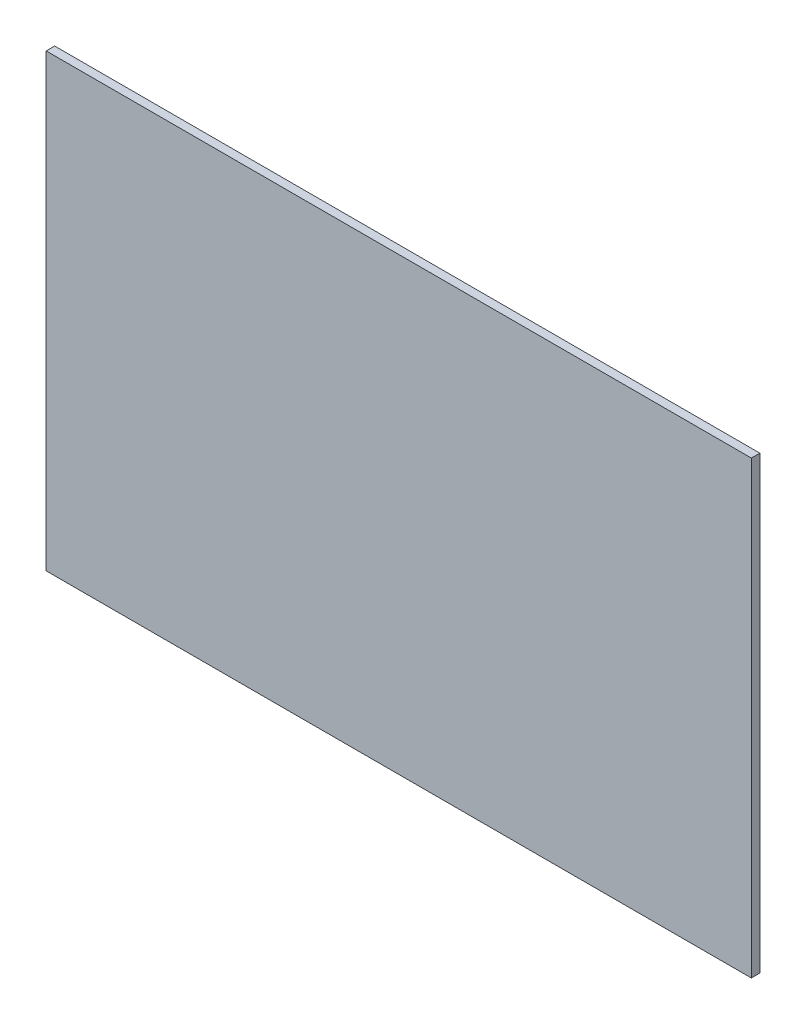
ISO-10303-21;
HEADER;
FILE_DESCRIPTION(('STEP AP214'),'2;1');
FILE_NAME('part.step','',(''),(''),'','','');
FILE_SCHEMA(('AUTOMOTIVE_DESIGN { 1 0 10303 214 1 1 1 1 }'));
ENDSEC;
DATA;
#1=APPLICATION_CONTEXT('core data for automotive mechanical design processes');
#2=APPLICATION_PROTOCOL_DEFINITION('international standard','automotive_design',2000,#1);
#3=PRODUCT_CONTEXT('',#1,'mechanical');
#4=PRODUCT('Part','Part','',(#3));
#5=PRODUCT_RELATED_PRODUCT_CATEGORY('part','',(#4));
#6=PRODUCT_DEFINITION_FORMATION('','',#4);
#7=PRODUCT_DEFINITION_CONTEXT('part definition',#1,'design');
#8=PRODUCT_DEFINITION('design','',#6,#7);
#9=PRODUCT_DEFINITION_SHAPE('','',#8);
#10=(LENGTH_UNIT() NAMED_UNIT(*) SI_UNIT(.MILLI.,.METRE.));
#11=(NAMED_UNIT(*) PLANE_ANGLE_UNIT() SI_UNIT($,.RADIAN.));
#12=(NAMED_UNIT(*) SI_UNIT($,.STERADIAN.) SOLID_ANGLE_UNIT());
#13=UNCERTAINTY_MEASURE_WITH_UNIT(LENGTH_MEASURE(1.E-05),#10,'distance_accuracy_value','');
#14=(GEOMETRIC_REPRESENTATION_CONTEXT(3) GLOBAL_UNCERTAINTY_ASSIGNED_CONTEXT((#13)) GLOBAL_UNIT_ASSIGNED_CONTEXT((#10,
#11,#12)) REPRESENTATION_CONTEXT('',''));
#15=CARTESIAN_POINT('',(0.,0.,0.));
#16=DIRECTION('',(0.,0.,1.));
#17=DIRECTION('',(1.,0.,0.));
#18=AXIS2_PLACEMENT_3D('',#15,#16,#17);
#19=CARTESIAN_POINT('',(83.,-53.,2.));
#20=DIRECTION('',(-1.,0.,0.));
#21=DIRECTION('',(0.,0.,1.));
#22=AXIS2_PLACEMENT_3D('',#19,#20,#21);
#23=PLANE('',#22);
#24=DIRECTION('',(0.,1.,0.));
#25=VECTOR('',#24,1.);
#26=CARTESIAN_POINT('',(83.,-53.,0.));
#27=LINE('',#26,#25);
#28=CARTESIAN_POINT('',(83.,-53.,0.));
#29=VERTEX_POINT('',#28);
#30=CARTESIAN_POINT('',(83.,53.,0.));
#31=VERTEX_POINT('',#30);
#32=EDGE_CURVE('E113',#29,#31,#27,.T.);
#33=ORIENTED_EDGE('',*,*,#32,.T.);
#34=DIRECTION('',(0.,0.,-1.));
#35=VECTOR('',#34,1.);
#36=CARTESIAN_POINT('',(83.,53.,2.));
#37=LINE('',#36,#35);
#38=CARTESIAN_POINT('',(83.,53.,2.));
#39=VERTEX_POINT('',#38);
#40=EDGE_CURVE('E11',#39,#31,#37,.T.);
#41=ORIENTED_EDGE('',*,*,#40,.F.);
#42=DIRECTION('',(0.,1.,0.));
#43=VECTOR('',#42,1.);
#44=CARTESIAN_POINT('',(83.,-53.,2.));
#45=LINE('',#44,#43);
#46=CARTESIAN_POINT('',(83.,-53.,2.));
#47=VERTEX_POINT('',#46);
#48=EDGE_CURVE('E97',#47,#39,#45,.T.);
#49=ORIENTED_EDGE('',*,*,#48,.F.);
#50=DIRECTION('',(0.,0.,-1.));
#51=VECTOR('',#50,1.);
#52=CARTESIAN_POINT('',(83.,-53.,2.));
#53=LINE('',#52,#51);
#54=EDGE_CURVE('E109',#47,#29,#53,.T.);
#55=ORIENTED_EDGE('',*,*,#54,.T.);
#56=EDGE_LOOP('',(#33,#41,#49,#55));
#57=FACE_BOUND('',#56,.T.);
#58=ADVANCED_FACE('F45',(#57),#23,.F.);
#59=CARTESIAN_POINT('',(-83.,53.,2.));
#60=DIRECTION('',(0.,-1.,0.));
#61=DIRECTION('',(0.,0.,-1.));
#62=AXIS2_PLACEMENT_3D('',#59,#60,#61);
#63=PLANE('',#62);
#64=DIRECTION('',(-1.,0.,0.));
#65=VECTOR('',#64,1.);
#66=CARTESIAN_POINT('',(-83.,53.,0.));
#67=LINE('',#66,#65);
#68=CARTESIAN_POINT('',(-83.,53.,0.));
#69=VERTEX_POINT('',#68);
#70=EDGE_CURVE('E102',#31,#69,#67,.T.);
#71=ORIENTED_EDGE('',*,*,#70,.T.);
#72=DIRECTION('',(0.,0.,-1.));
#73=VECTOR('',#72,1.);
#74=CARTESIAN_POINT('',(-83.,53.,2.));
#75=LINE('',#74,#73);
#76=CARTESIAN_POINT('',(-83.,53.,2.));
#77=VERTEX_POINT('',#76);
#78=EDGE_CURVE('E54',#77,#69,#75,.T.);
#79=ORIENTED_EDGE('',*,*,#78,.F.);
#80=DIRECTION('',(-1.,0.,0.));
#81=VECTOR('',#80,1.);
#82=CARTESIAN_POINT('',(-83.,53.,2.));
#83=LINE('',#82,#81);
#84=EDGE_CURVE('E92',#39,#77,#83,.T.);
#85=ORIENTED_EDGE('',*,*,#84,.F.);
#86=ORIENTED_EDGE('',*,*,#40,.T.);
#87=EDGE_LOOP('',(#71,#79,#85,#86));
#88=FACE_BOUND('',#87,.T.);
#89=ADVANCED_FACE('F101',(#88),#63,.F.);
#90=CARTESIAN_POINT('',(-83.,-53.,2.));
#91=DIRECTION('',(1.,0.,0.));
#92=DIRECTION('',(0.,0.,-1.));
#93=AXIS2_PLACEMENT_3D('',#90,#91,#92);
#94=PLANE('',#93);
#95=DIRECTION('',(0.,-1.,0.));
#96=VECTOR('',#95,1.);
#97=CARTESIAN_POINT('',(-83.,-53.,0.));
#98=LINE('',#97,#96);
#99=CARTESIAN_POINT('',(-83.,-53.,0.));
#100=VERTEX_POINT('',#99);
#101=EDGE_CURVE('E79',#69,#100,#98,.T.);
#102=ORIENTED_EDGE('',*,*,#101,.T.);
#103=DIRECTION('',(0.,0.,-1.));
#104=VECTOR('',#103,1.);
#105=CARTESIAN_POINT('',(-83.,-53.,2.));
#106=LINE('',#105,#104);
#107=CARTESIAN_POINT('',(-83.,-53.,2.));
#108=VERTEX_POINT('',#107);
#109=EDGE_CURVE('E104',#108,#100,#106,.T.);
#110=ORIENTED_EDGE('',*,*,#109,.F.);
#111=DIRECTION('',(0.,-1.,0.));
#112=VECTOR('',#111,1.);
#113=CARTESIAN_POINT('',(-83.,-53.,2.));
#114=LINE('',#113,#112);
#115=EDGE_CURVE('E95',#77,#108,#114,.T.);
#116=ORIENTED_EDGE('',*,*,#115,.F.);
#117=ORIENTED_EDGE('',*,*,#78,.T.);
#118=EDGE_LOOP('',(#102,#110,#116,#117));
#119=FACE_BOUND('',#118,.T.);
#120=ADVANCED_FACE('F105',(#119),#94,.F.);
#121=CARTESIAN_POINT('',(-83.,-53.,2.));
#122=DIRECTION('',(0.,1.,0.));
#123=DIRECTION('',(0.,0.,1.));
#124=AXIS2_PLACEMENT_3D('',#121,#122,#123);
#125=PLANE('',#124);
#126=DIRECTION('',(1.,0.,0.));
#127=VECTOR('',#126,1.);
#128=CARTESIAN_POINT('',(-83.,-53.,0.));
#129=LINE('',#128,#127);
#130=EDGE_CURVE('E85',#100,#29,#129,.T.);
#131=ORIENTED_EDGE('',*,*,#130,.T.);
#132=ORIENTED_EDGE('',*,*,#54,.F.);
#133=DIRECTION('',(1.,0.,0.));
#134=VECTOR('',#133,1.);
#135=CARTESIAN_POINT('',(-83.,-53.,2.));
#136=LINE('',#135,#134);
#137=EDGE_CURVE('E62',#108,#47,#136,.T.);
#138=ORIENTED_EDGE('',*,*,#137,.F.);
#139=ORIENTED_EDGE('',*,*,#109,.T.);
#140=EDGE_LOOP('',(#131,#132,#138,#139));
#141=FACE_BOUND('',#140,.T.);
#142=ADVANCED_FACE('F126',(#141),#125,.F.);
#143=CARTESIAN_POINT('',(0.,0.,2.));
#144=DIRECTION('',(0.,0.,-1.));
#145=DIRECTION('',(-1.,0.,0.));
#146=AXIS2_PLACEMENT_3D('',#143,#144,#145);
#147=PLANE('',#146);
#148=ORIENTED_EDGE('',*,*,#48,.T.);
#149=ORIENTED_EDGE('',*,*,#84,.T.);
#150=ORIENTED_EDGE('',*,*,#115,.T.);
#151=ORIENTED_EDGE('',*,*,#137,.T.);
#152=EDGE_LOOP('',(#148,#149,#150,#151));
#153=FACE_BOUND('',#152,.T.);
#154=ADVANCED_FACE('F93',(#153),#147,.F.);
#155=CARTESIAN_POINT('',(0.,0.,0.));
#156=DIRECTION('',(0.,0.,-1.));
#157=DIRECTION('',(-1.,0.,0.));
#158=AXIS2_PLACEMENT_3D('',#155,#156,#157);
#159=PLANE('',#158);
#160=ORIENTED_EDGE('',*,*,#32,.F.);
#161=ORIENTED_EDGE('',*,*,#130,.F.);
#162=ORIENTED_EDGE('',*,*,#101,.F.);
#163=ORIENTED_EDGE('',*,*,#70,.F.);
#164=EDGE_LOOP('',(#160,#161,#162,#163));
#165=FACE_BOUND('',#164,.T.);
#166=ADVANCED_FACE('F129',(#165),#159,.T.);
#167=CLOSED_SHELL('',(#58,#89,#120,#142,#154,#166));
#168=MANIFOLD_SOLID_BREP('B2',#167);
#169=ADVANCED_BREP_SHAPE_REPRESENTATION('',(#18,#168),#14);
#170=SHAPE_DEFINITION_REPRESENTATION(#9,#169);
ENDSEC;
END-ISO-10303-21;
